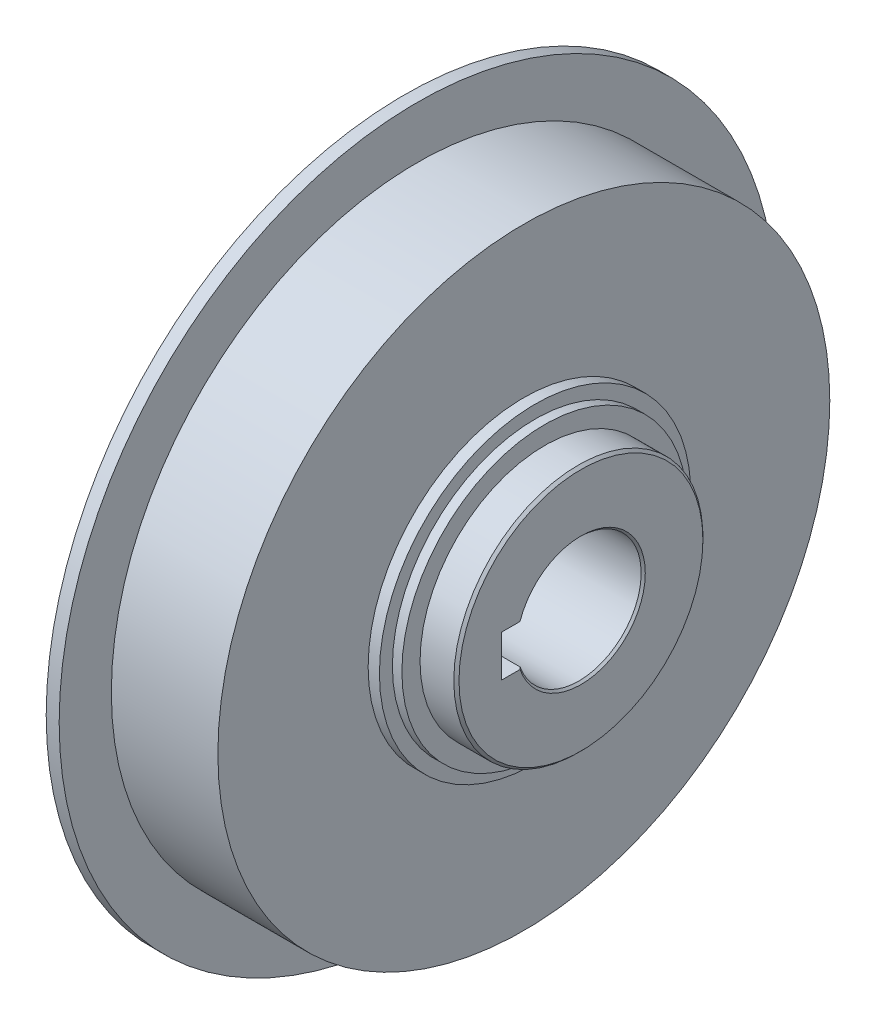
ISO-10303-21;
HEADER;
FILE_DESCRIPTION(('STEP AP214'),'2;1');
FILE_NAME('part.step','',(''),(''),'','','');
FILE_SCHEMA(('AUTOMOTIVE_DESIGN { 1 0 10303 214 1 1 1 1 }'));
ENDSEC;
DATA;
#1=APPLICATION_CONTEXT('core data for automotive mechanical design processes');
#2=APPLICATION_PROTOCOL_DEFINITION('international standard','automotive_design',2000,#1);
#3=PRODUCT_CONTEXT('',#1,'mechanical');
#4=PRODUCT('Part','Part','',(#3));
#5=PRODUCT_RELATED_PRODUCT_CATEGORY('part','',(#4));
#6=PRODUCT_DEFINITION_FORMATION('','',#4);
#7=PRODUCT_DEFINITION_CONTEXT('part definition',#1,'design');
#8=PRODUCT_DEFINITION('design','',#6,#7);
#9=PRODUCT_DEFINITION_SHAPE('','',#8);
#10=(LENGTH_UNIT() NAMED_UNIT(*) SI_UNIT(.MILLI.,.METRE.));
#11=(NAMED_UNIT(*) PLANE_ANGLE_UNIT() SI_UNIT($,.RADIAN.));
#12=(NAMED_UNIT(*) SI_UNIT($,.STERADIAN.) SOLID_ANGLE_UNIT());
#13=UNCERTAINTY_MEASURE_WITH_UNIT(LENGTH_MEASURE(1.E-05),#10,'distance_accuracy_value','');
#14=(GEOMETRIC_REPRESENTATION_CONTEXT(3) GLOBAL_UNCERTAINTY_ASSIGNED_CONTEXT((#13)) GLOBAL_UNIT_ASSIGNED_CONTEXT((#10,
#11,#12)) REPRESENTATION_CONTEXT('',''));
#15=CARTESIAN_POINT('',(0.,0.,0.));
#16=DIRECTION('',(0.,0.,1.));
#17=DIRECTION('',(1.,0.,0.));
#18=AXIS2_PLACEMENT_3D('',#15,#16,#17);
#19=CARTESIAN_POINT('',(83.1,0.,0.));
#20=DIRECTION('',(1.,0.,0.));
#21=DIRECTION('',(0.,0.,-1.));
#22=AXIS2_PLACEMENT_3D('',#19,#20,#21);
#23=CONICAL_SURFACE('',#22,12.4,0.78539816339744);
#24=CARTESIAN_POINT('',(82.7,0.,0.));
#25=DIRECTION('',(-1.,0.,0.));
#26=DIRECTION('',(0.,0.,1.));
#27=AXIS2_PLACEMENT_3D('',#24,#25,#26);
#28=CIRCLE('',#27,12.);
#29=CARTESIAN_POINT('',(82.7,4.,11.3137084989848));
#30=VERTEX_POINT('',#29);
#31=CARTESIAN_POINT('',(82.7,-4.,11.3137084989848));
#32=VERTEX_POINT('',#31);
#33=EDGE_CURVE('E80',#30,#32,#28,.T.);
#34=ORIENTED_EDGE('',*,*,#33,.T.);
#35=CARTESIAN_POINT('',(83.1,-4.,11.737120600897));
#36=CARTESIAN_POINT('',(83.0332637530497,-4.,11.6666176506962));
#37=CARTESIAN_POINT('',(82.9665622963739,-4.,11.5960818339105));
#38=CARTESIAN_POINT('',(82.83322896304,-4.,11.454944466607));
#39=CARTESIAN_POINT('',(82.7665970863825,-4.,11.3843429160886));
#40=CARTESIAN_POINT('',(82.7,-4.,11.3137084989848));
#41=B_SPLINE_CURVE_WITH_KNOTS('',3,(#35,#36,#37,#38,#39,#40),.UNSPECIFIED.,.F.,.F.,(4,2,4),(0.,
0.291237827128769,0.582475656578388),.UNSPECIFIED.);
#42=CARTESIAN_POINT('',(83.1,-4.,11.737120600897));
#43=VERTEX_POINT('',#42);
#44=EDGE_CURVE('E75',#43,#32,#41,.T.);
#45=ORIENTED_EDGE('',*,*,#44,.F.);
#46=CARTESIAN_POINT('',(83.1,0.,0.));
#47=DIRECTION('',(1.,0.,0.));
#48=DIRECTION('',(0.,0.,-1.));
#49=AXIS2_PLACEMENT_3D('',#46,#47,#48);
#50=CIRCLE('',#49,12.4);
#51=CARTESIAN_POINT('',(83.1,4.,11.737120600897));
#52=VERTEX_POINT('',#51);
#53=EDGE_CURVE('E73',#52,#43,#50,.F.);
#54=ORIENTED_EDGE('',*,*,#53,.F.);
#55=CARTESIAN_POINT('',(82.7,4.,11.3137084989848));
#56=CARTESIAN_POINT('',(82.7665970863825,4.,11.3843429160886));
#57=CARTESIAN_POINT('',(82.83322896304,4.,11.454944466607));
#58=CARTESIAN_POINT('',(82.9665622963739,4.,11.5960818339105));
#59=CARTESIAN_POINT('',(83.0332637530497,4.,11.6666176506962));
#60=CARTESIAN_POINT('',(83.1,4.,11.737120600897));
#61=B_SPLINE_CURVE_WITH_KNOTS('',3,(#55,#56,#57,#58,#59,#60),.UNSPECIFIED.,.F.,.F.,(4,2,4),(0.,
0.291237829449622,0.582475656578395),.UNSPECIFIED.);
#62=EDGE_CURVE('E21',#30,#52,#61,.T.);
#63=ORIENTED_EDGE('',*,*,#62,.F.);
#64=EDGE_LOOP('',(#34,#45,#54,#63));
#65=FACE_BOUND('',#64,.T.);
#66=ADVANCED_FACE('F17',(#65),#23,.F.);
#67=CARTESIAN_POINT('',(60.8,0.,0.));
#68=DIRECTION('',(-1.,0.,0.));
#69=DIRECTION('',(0.,0.,1.));
#70=AXIS2_PLACEMENT_3D('',#67,#68,#69);
#71=CYLINDRICAL_SURFACE('',#70,12.);
#72=ORIENTED_EDGE('',*,*,#33,.F.);
#73=DIRECTION('',(1.,0.,0.));
#74=VECTOR('',#73,1.);
#75=CARTESIAN_POINT('',(60.8,4.,11.3137084989848));
#76=LINE('',#75,#74);
#77=CARTESIAN_POINT('',(38.9,4.,11.3137084989848));
#78=VERTEX_POINT('',#77);
#79=EDGE_CURVE('E88',#78,#30,#76,.T.);
#80=ORIENTED_EDGE('',*,*,#79,.F.);
#81=CARTESIAN_POINT('',(38.9,0.,0.));
#82=DIRECTION('',(-1.,0.,0.));
#83=DIRECTION('',(0.,0.,1.));
#84=AXIS2_PLACEMENT_3D('',#81,#82,#83);
#85=CIRCLE('',#84,12.);
#86=CARTESIAN_POINT('',(38.9,-4.,11.3137084989848));
#87=VERTEX_POINT('',#86);
#88=EDGE_CURVE('E94',#78,#87,#85,.T.);
#89=ORIENTED_EDGE('',*,*,#88,.T.);
#90=DIRECTION('',(1.,0.,0.));
#91=VECTOR('',#90,1.);
#92=CARTESIAN_POINT('',(60.8,-4.,11.3137084989848));
#93=LINE('',#92,#91);
#94=EDGE_CURVE('E79',#32,#87,#93,.F.);
#95=ORIENTED_EDGE('',*,*,#94,.F.);
#96=EDGE_LOOP('',(#72,#80,#89,#95));
#97=FACE_BOUND('',#96,.T.);
#98=ADVANCED_FACE('F308',(#97),#71,.F.);
#99=CARTESIAN_POINT('',(83.1,0.,17.95));
#100=DIRECTION('',(1.,0.,0.));
#101=DIRECTION('',(0.,0.,-1.));
#102=AXIS2_PLACEMENT_3D('',#99,#100,#101);
#103=PLANE('',#102);
#104=DIRECTION('',(0.,0.,-1.));
#105=VECTOR('',#104,1.);
#106=CARTESIAN_POINT('',(83.1,4.,7.65));
#107=LINE('',#106,#105);
#108=CARTESIAN_POINT('',(83.1,4.,15.3));
#109=VERTEX_POINT('',#108);
#110=EDGE_CURVE('E85',#52,#109,#107,.F.);
#111=ORIENTED_EDGE('',*,*,#110,.F.);
#112=ORIENTED_EDGE('',*,*,#53,.T.);
#113=DIRECTION('',(0.,0.,1.));
#114=VECTOR('',#113,1.);
#115=CARTESIAN_POINT('',(83.1,-4.,7.65));
#116=LINE('',#115,#114);
#117=CARTESIAN_POINT('',(83.1,-4.,15.3));
#118=VERTEX_POINT('',#117);
#119=EDGE_CURVE('E110',#118,#43,#116,.F.);
#120=ORIENTED_EDGE('',*,*,#119,.F.);
#121=DIRECTION('',(0.,1.,0.));
#122=VECTOR('',#121,1.);
#123=CARTESIAN_POINT('',(83.1,0.,15.3));
#124=LINE('',#123,#122);
#125=EDGE_CURVE('E92',#118,#109,#124,.T.);
#126=ORIENTED_EDGE('',*,*,#125,.T.);
#127=EDGE_LOOP('',(#111,#112,#120,#126));
#128=FACE_BOUND('',#127,.T.);
#129=CARTESIAN_POINT('',(83.1,0.,0.));
#130=DIRECTION('',(-1.,0.,0.));
#131=DIRECTION('',(0.,0.,1.));
#132=AXIS2_PLACEMENT_3D('',#129,#130,#131);
#133=CIRCLE('',#132,23.5);
#134=CARTESIAN_POINT('',(83.1,0.,23.5));
#135=VERTEX_POINT('',#134);
#136=EDGE_CURVE('E149',#135,#135,#133,.T.);
#137=ORIENTED_EDGE('',*,*,#136,.F.);
#138=EDGE_LOOP('',(#137));
#139=FACE_BOUND('',#138,.T.);
#140=ADVANCED_FACE('F89',(#128,#139),#103,.T.);
#141=CARTESIAN_POINT('',(60.8,-4.,7.65));
#142=DIRECTION('',(0.,1.,0.));
#143=DIRECTION('',(0.,0.,1.));
#144=AXIS2_PLACEMENT_3D('',#141,#142,#143);
#145=PLANE('',#144);
#146=DIRECTION('',(1.,0.,0.));
#147=VECTOR('',#146,1.);
#148=CARTESIAN_POINT('',(60.8,-4.,15.3));
#149=LINE('',#148,#147);
#150=CARTESIAN_POINT('',(38.5,-4.,15.3));
#151=VERTEX_POINT('',#150);
#152=EDGE_CURVE('E384',#151,#118,#149,.T.);
#153=ORIENTED_EDGE('',*,*,#152,.T.);
#154=ORIENTED_EDGE('',*,*,#119,.T.);
#155=ORIENTED_EDGE('',*,*,#44,.T.);
#156=ORIENTED_EDGE('',*,*,#94,.T.);
#157=CARTESIAN_POINT('',(38.9,-4.,11.3137084989848));
#158=CARTESIAN_POINT('',(38.8334029136175,-4.,11.3843429160886));
#159=CARTESIAN_POINT('',(38.76677103696,-4.,11.454944466607));
#160=CARTESIAN_POINT('',(38.6334377036261,-4.,11.5960818339105));
#161=CARTESIAN_POINT('',(38.5667362469503,-4.,11.6666176506962));
#162=CARTESIAN_POINT('',(38.5,-4.,11.737120600897));
#163=B_SPLINE_CURVE_WITH_KNOTS('',3,(#157,#158,#159,#160,#161,#162),.UNSPECIFIED.,.F.,.F.,(4,2,
4),(0.,0.291237829449626,0.582475656578401),.UNSPECIFIED.);
#164=CARTESIAN_POINT('',(38.5,-4.,11.737120600897));
#165=VERTEX_POINT('',#164);
#166=EDGE_CURVE('E97',#87,#165,#163,.T.);
#167=ORIENTED_EDGE('',*,*,#166,.T.);
#168=DIRECTION('',(0.,0.,1.));
#169=VECTOR('',#168,1.);
#170=CARTESIAN_POINT('',(38.5,-4.,32.2625));
#171=LINE('',#170,#169);
#172=EDGE_CURVE('E148',#151,#165,#171,.F.);
#173=ORIENTED_EDGE('',*,*,#172,.F.);
#174=EDGE_LOOP('',(#153,#154,#155,#156,#167,#173));
#175=FACE_BOUND('',#174,.T.);
#176=ADVANCED_FACE('F295',(#175),#145,.T.);
#177=CARTESIAN_POINT('',(38.5,0.,0.));
#178=DIRECTION('',(-1.,0.,0.));
#179=DIRECTION('',(0.,0.,1.));
#180=AXIS2_PLACEMENT_3D('',#177,#178,#179);
#181=CONICAL_SURFACE('',#180,12.4,0.78539816339745);
#182=ORIENTED_EDGE('',*,*,#88,.F.);
#183=CARTESIAN_POINT('',(38.5,4.,11.737120600897));
#184=CARTESIAN_POINT('',(38.5667362469503,4.,11.6666176506962));
#185=CARTESIAN_POINT('',(38.6334377036261,4.,11.5960818339105));
#186=CARTESIAN_POINT('',(38.76677103696,4.,11.454944466607));
#187=CARTESIAN_POINT('',(38.8334029136175,4.,11.3843429160886));
#188=CARTESIAN_POINT('',(38.9,4.,11.3137084989848));
#189=B_SPLINE_CURVE_WITH_KNOTS('',3,(#183,#184,#185,#186,#187,#188),.UNSPECIFIED.,.F.,.F.,(4,2,
4),(0.,0.291237827128765,0.582475656578379),.UNSPECIFIED.);
#190=CARTESIAN_POINT('',(38.5,4.,11.737120600897));
#191=VERTEX_POINT('',#190);
#192=EDGE_CURVE('E93',#191,#78,#189,.T.);
#193=ORIENTED_EDGE('',*,*,#192,.F.);
#194=CARTESIAN_POINT('',(38.5,0.,0.));
#195=DIRECTION('',(-1.,0.,0.));
#196=DIRECTION('',(0.,0.,1.));
#197=AXIS2_PLACEMENT_3D('',#194,#195,#196);
#198=CIRCLE('',#197,12.4);
#199=EDGE_CURVE('E144',#165,#191,#198,.F.);
#200=ORIENTED_EDGE('',*,*,#199,.F.);
#201=ORIENTED_EDGE('',*,*,#166,.F.);
#202=EDGE_LOOP('',(#182,#193,#200,#201));
#203=FACE_BOUND('',#202,.T.);
#204=ADVANCED_FACE('F160',(#203),#181,.F.);
#205=CARTESIAN_POINT('',(60.8,4.,7.65));
#206=DIRECTION('',(0.,-1.,0.));
#207=DIRECTION('',(0.,0.,-1.));
#208=AXIS2_PLACEMENT_3D('',#205,#206,#207);
#209=PLANE('',#208);
#210=ORIENTED_EDGE('',*,*,#192,.T.);
#211=ORIENTED_EDGE('',*,*,#79,.T.);
#212=ORIENTED_EDGE('',*,*,#62,.T.);
#213=ORIENTED_EDGE('',*,*,#110,.T.);
#214=DIRECTION('',(1.,0.,0.));
#215=VECTOR('',#214,1.);
#216=CARTESIAN_POINT('',(60.8,4.,15.3));
#217=LINE('',#216,#215);
#218=CARTESIAN_POINT('',(38.5,4.,15.3));
#219=VERTEX_POINT('',#218);
#220=EDGE_CURVE('E40',#109,#219,#217,.F.);
#221=ORIENTED_EDGE('',*,*,#220,.T.);
#222=DIRECTION('',(0.,0.,1.));
#223=VECTOR('',#222,1.);
#224=CARTESIAN_POINT('',(38.5,4.,32.2625));
#225=LINE('',#224,#223);
#226=EDGE_CURVE('E147',#191,#219,#225,.T.);
#227=ORIENTED_EDGE('',*,*,#226,.F.);
#228=EDGE_LOOP('',(#210,#211,#212,#213,#221,#227));
#229=FACE_BOUND('',#228,.T.);
#230=ADVANCED_FACE('F84',(#229),#209,.T.);
#231=CARTESIAN_POINT('',(60.8,0.,15.3));
#232=DIRECTION('',(0.,0.,1.));
#233=DIRECTION('',(1.,0.,0.));
#234=AXIS2_PLACEMENT_3D('',#231,#232,#233);
#235=PLANE('',#234);
#236=ORIENTED_EDGE('',*,*,#152,.F.);
#237=DIRECTION('',(0.,1.,0.));
#238=VECTOR('',#237,1.);
#239=CARTESIAN_POINT('',(38.5,0.,15.3));
#240=LINE('',#239,#238);
#241=EDGE_CURVE('E392',#219,#151,#240,.F.);
#242=ORIENTED_EDGE('',*,*,#241,.F.);
#243=ORIENTED_EDGE('',*,*,#220,.F.);
#244=ORIENTED_EDGE('',*,*,#125,.F.);
#245=EDGE_LOOP('',(#236,#242,#243,#244));
#246=FACE_BOUND('',#245,.T.);
#247=ADVANCED_FACE('F165',(#246),#235,.F.);
#248=CARTESIAN_POINT('',(82.6,0.,0.));
#249=DIRECTION('',(-1.,0.,0.));
#250=DIRECTION('',(0.,0.,1.));
#251=AXIS2_PLACEMENT_3D('',#248,#249,#250);
#252=CONICAL_SURFACE('',#251,24.,0.785398163397448);
#253=ORIENTED_EDGE('',*,*,#136,.T.);
#254=EDGE_LOOP('',(#253));
#255=FACE_BOUND('',#254,.T.);
#256=CARTESIAN_POINT('',(82.6,0.,0.));
#257=DIRECTION('',(-1.,0.,0.));
#258=DIRECTION('',(0.,0.,1.));
#259=AXIS2_PLACEMENT_3D('',#256,#257,#258);
#260=CIRCLE('',#259,24.);
#261=CARTESIAN_POINT('',(82.6,0.,24.));
#262=VERTEX_POINT('',#261);
#263=EDGE_CURVE('E143',#262,#262,#260,.T.);
#264=ORIENTED_EDGE('',*,*,#263,.F.);
#265=EDGE_LOOP('',(#264));
#266=FACE_BOUND('',#265,.T.);
#267=ADVANCED_FACE('F169',(#255,#266),#252,.T.);
#268=CARTESIAN_POINT('',(38.5,0.,32.2625));
#269=DIRECTION('',(-1.,0.,0.));
#270=DIRECTION('',(0.,0.,1.));
#271=AXIS2_PLACEMENT_3D('',#268,#269,#270);
#272=PLANE('',#271);
#273=CARTESIAN_POINT('',(38.5,0.,0.));
#274=DIRECTION('',(-1.,0.,0.));
#275=DIRECTION('',(0.,0.,1.));
#276=AXIS2_PLACEMENT_3D('',#273,#274,#275);
#277=CIRCLE('',#276,52.125);
#278=CARTESIAN_POINT('',(38.5,0.,52.125));
#279=VERTEX_POINT('',#278);
#280=EDGE_CURVE('E140',#279,#279,#277,.F.);
#281=ORIENTED_EDGE('',*,*,#280,.F.);
#282=EDGE_LOOP('',(#281));
#283=FACE_BOUND('',#282,.T.);
#284=ORIENTED_EDGE('',*,*,#226,.T.);
#285=ORIENTED_EDGE('',*,*,#241,.T.);
#286=ORIENTED_EDGE('',*,*,#172,.T.);
#287=ORIENTED_EDGE('',*,*,#199,.T.);
#288=EDGE_LOOP('',(#284,#285,#286,#287));
#289=FACE_BOUND('',#288,.T.);
#290=ADVANCED_FACE('F173',(#283,#289),#272,.T.);
#291=CARTESIAN_POINT('',(79.35,0.,0.));
#292=DIRECTION('',(-1.,0.,0.));
#293=DIRECTION('',(0.,0.,1.));
#294=AXIS2_PLACEMENT_3D('',#291,#292,#293);
#295=CYLINDRICAL_SURFACE('',#294,24.);
#296=ORIENTED_EDGE('',*,*,#263,.T.);
#297=EDGE_LOOP('',(#296));
#298=FACE_BOUND('',#297,.T.);
#299=CARTESIAN_POINT('',(76.1,0.,0.));
#300=DIRECTION('',(-1.,0.,0.));
#301=DIRECTION('',(0.,0.,1.));
#302=AXIS2_PLACEMENT_3D('',#299,#300,#301);
#303=CIRCLE('',#302,24.);
#304=CARTESIAN_POINT('',(76.1,0.,24.));
#305=VERTEX_POINT('',#304);
#306=EDGE_CURVE('E137',#305,#305,#303,.T.);
#307=ORIENTED_EDGE('',*,*,#306,.F.);
#308=EDGE_LOOP('',(#307));
#309=FACE_BOUND('',#308,.T.);
#310=ADVANCED_FACE('F177',(#298,#309),#295,.T.);
#311=CARTESIAN_POINT('',(43.785,0.,0.));
#312=DIRECTION('',(-1.,0.,0.));
#313=DIRECTION('',(0.,0.,1.));
#314=AXIS2_PLACEMENT_3D('',#311,#312,#313);
#315=CYLINDRICAL_SURFACE('',#314,52.125);
#316=CARTESIAN_POINT('',(49.07,0.,0.));
#317=DIRECTION('',(-1.,0.,0.));
#318=DIRECTION('',(0.,0.,1.));
#319=AXIS2_PLACEMENT_3D('',#316,#317,#318);
#320=CIRCLE('',#319,52.125);
#321=CARTESIAN_POINT('',(49.07,0.,52.125));
#322=VERTEX_POINT('',#321);
#323=EDGE_CURVE('E134',#322,#322,#320,.F.);
#324=ORIENTED_EDGE('',*,*,#323,.F.);
#325=EDGE_LOOP('',(#324));
#326=FACE_BOUND('',#325,.T.);
#327=ORIENTED_EDGE('',*,*,#280,.T.);
#328=EDGE_LOOP('',(#327));
#329=FACE_BOUND('',#328,.T.);
#330=ADVANCED_FACE('F181',(#326,#329),#315,.T.);
#331=CARTESIAN_POINT('',(76.1,0.,25.75));
#332=DIRECTION('',(1.,0.,0.));
#333=DIRECTION('',(0.,0.,-1.));
#334=AXIS2_PLACEMENT_3D('',#331,#332,#333);
#335=PLANE('',#334);
#336=CARTESIAN_POINT('',(76.1,0.,0.));
#337=DIRECTION('',(-1.,0.,0.));
#338=DIRECTION('',(0.,0.,1.));
#339=AXIS2_PLACEMENT_3D('',#336,#337,#338);
#340=CIRCLE('',#339,27.5);
#341=CARTESIAN_POINT('',(76.1,0.,27.5));
#342=VERTEX_POINT('',#341);
#343=EDGE_CURVE('E131',#342,#342,#340,.T.);
#344=ORIENTED_EDGE('',*,*,#343,.F.);
#345=EDGE_LOOP('',(#344));
#346=FACE_BOUND('',#345,.T.);
#347=ORIENTED_EDGE('',*,*,#306,.T.);
#348=EDGE_LOOP('',(#347));
#349=FACE_BOUND('',#348,.T.);
#350=ADVANCED_FACE('F185',(#346,#349),#335,.T.);
#351=CARTESIAN_POINT('',(49.07,0.,60.5625));
#352=DIRECTION('',(-1.,0.,0.));
#353=DIRECTION('',(0.,0.,1.));
#354=AXIS2_PLACEMENT_3D('',#351,#352,#353);
#355=PLANE('',#354);
#356=ORIENTED_EDGE('',*,*,#323,.T.);
#357=EDGE_LOOP('',(#356));
#358=FACE_BOUND('',#357,.T.);
#359=CARTESIAN_POINT('',(49.07,0.,0.));
#360=DIRECTION('',(-1.,0.,0.));
#361=DIRECTION('',(0.,0.,1.));
#362=AXIS2_PLACEMENT_3D('',#359,#360,#361);
#363=CIRCLE('',#362,69.);
#364=CARTESIAN_POINT('',(49.07,0.,69.));
#365=VERTEX_POINT('',#364);
#366=EDGE_CURVE('E128',#365,#365,#363,.F.);
#367=ORIENTED_EDGE('',*,*,#366,.F.);
#368=EDGE_LOOP('',(#367));
#369=FACE_BOUND('',#368,.T.);
#370=ADVANCED_FACE('F189',(#358,#369),#355,.T.);
#371=CARTESIAN_POINT('',(75.185,0.,0.));
#372=DIRECTION('',(-1.,0.,0.));
#373=DIRECTION('',(0.,0.,1.));
#374=AXIS2_PLACEMENT_3D('',#371,#372,#373);
#375=CYLINDRICAL_SURFACE('',#374,27.5);
#376=ORIENTED_EDGE('',*,*,#343,.T.);
#377=EDGE_LOOP('',(#376));
#378=FACE_BOUND('',#377,.T.);
#379=CARTESIAN_POINT('',(74.27,0.,0.));
#380=DIRECTION('',(-1.,0.,0.));
#381=DIRECTION('',(0.,0.,1.));
#382=AXIS2_PLACEMENT_3D('',#379,#380,#381);
#383=CIRCLE('',#382,27.5);
#384=CARTESIAN_POINT('',(74.27,0.,27.5));
#385=VERTEX_POINT('',#384);
#386=EDGE_CURVE('E125',#385,#385,#383,.T.);
#387=ORIENTED_EDGE('',*,*,#386,.F.);
#388=EDGE_LOOP('',(#387));
#389=FACE_BOUND('',#388,.T.);
#390=ADVANCED_FACE('F193',(#378,#389),#375,.T.);
#391=CARTESIAN_POINT('',(50.32,0.,0.));
#392=DIRECTION('',(-1.,0.,0.));
#393=DIRECTION('',(0.,0.,1.));
#394=AXIS2_PLACEMENT_3D('',#391,#392,#393);
#395=CYLINDRICAL_SURFACE('',#394,69.);
#396=CARTESIAN_POINT('',(51.57,0.,0.));
#397=DIRECTION('',(-1.,0.,0.));
#398=DIRECTION('',(0.,0.,1.));
#399=AXIS2_PLACEMENT_3D('',#396,#397,#398);
#400=CIRCLE('',#399,69.);
#401=CARTESIAN_POINT('',(51.57,0.,69.));
#402=VERTEX_POINT('',#401);
#403=EDGE_CURVE('E122',#402,#402,#400,.F.);
#404=ORIENTED_EDGE('',*,*,#403,.F.);
#405=EDGE_LOOP('',(#404));
#406=FACE_BOUND('',#405,.T.);
#407=ORIENTED_EDGE('',*,*,#366,.T.);
#408=EDGE_LOOP('',(#407));
#409=FACE_BOUND('',#408,.T.);
#410=ADVANCED_FACE('F197',(#406,#409),#395,.T.);
#411=CARTESIAN_POINT('',(74.27,0.,28.75));
#412=DIRECTION('',(1.,0.,0.));
#413=DIRECTION('',(0.,0.,-1.));
#414=AXIS2_PLACEMENT_3D('',#411,#412,#413);
#415=PLANE('',#414);
#416=CARTESIAN_POINT('',(74.27,0.,0.));
#417=DIRECTION('',(-1.,0.,0.));
#418=DIRECTION('',(0.,0.,1.));
#419=AXIS2_PLACEMENT_3D('',#416,#417,#418);
#420=CIRCLE('',#419,30.);
#421=CARTESIAN_POINT('',(74.27,0.,30.));
#422=VERTEX_POINT('',#421);
#423=EDGE_CURVE('E119',#422,#422,#420,.T.);
#424=ORIENTED_EDGE('',*,*,#423,.F.);
#425=EDGE_LOOP('',(#424));
#426=FACE_BOUND('',#425,.T.);
#427=ORIENTED_EDGE('',*,*,#386,.T.);
#428=EDGE_LOOP('',(#427));
#429=FACE_BOUND('',#428,.T.);
#430=ADVANCED_FACE('F201',(#426,#429),#415,.T.);
#431=CARTESIAN_POINT('',(51.57,0.,63.975));
#432=DIRECTION('',(1.,0.,0.));
#433=DIRECTION('',(0.,0.,-1.));
#434=AXIS2_PLACEMENT_3D('',#431,#432,#433);
#435=PLANE('',#434);
#436=ORIENTED_EDGE('',*,*,#403,.T.);
#437=EDGE_LOOP('',(#436));
#438=FACE_BOUND('',#437,.T.);
#439=CARTESIAN_POINT('',(51.57,0.,0.));
#440=DIRECTION('',(-1.,0.,0.));
#441=DIRECTION('',(0.,0.,1.));
#442=AXIS2_PLACEMENT_3D('',#439,#440,#441);
#443=CIRCLE('',#442,58.95);
#444=CARTESIAN_POINT('',(51.57,0.,58.95));
#445=VERTEX_POINT('',#444);
#446=EDGE_CURVE('E116',#445,#445,#443,.F.);
#447=ORIENTED_EDGE('',*,*,#446,.F.);
#448=EDGE_LOOP('',(#447));
#449=FACE_BOUND('',#448,.T.);
#450=ADVANCED_FACE('F205',(#438,#449),#435,.T.);
#451=CARTESIAN_POINT('',(73.185,0.,0.));
#452=DIRECTION('',(-1.,0.,0.));
#453=DIRECTION('',(0.,0.,1.));
#454=AXIS2_PLACEMENT_3D('',#451,#452,#453);
#455=CYLINDRICAL_SURFACE('',#454,30.);
#456=ORIENTED_EDGE('',*,*,#423,.T.);
#457=EDGE_LOOP('',(#456));
#458=FACE_BOUND('',#457,.T.);
#459=CARTESIAN_POINT('',(72.1,0.,0.));
#460=DIRECTION('',(-1.,0.,0.));
#461=DIRECTION('',(0.,0.,1.));
#462=AXIS2_PLACEMENT_3D('',#459,#460,#461);
#463=CIRCLE('',#462,30.);
#464=CARTESIAN_POINT('',(72.1,0.,30.));
#465=VERTEX_POINT('',#464);
#466=EDGE_CURVE('E31',#465,#465,#463,.T.);
#467=ORIENTED_EDGE('',*,*,#466,.F.);
#468=EDGE_LOOP('',(#467));
#469=FACE_BOUND('',#468,.T.);
#470=ADVANCED_FACE('F209',(#458,#469),#455,.T.);
#471=CARTESIAN_POINT('',(61.835,0.,0.));
#472=DIRECTION('',(-1.,0.,0.));
#473=DIRECTION('',(0.,0.,1.));
#474=AXIS2_PLACEMENT_3D('',#471,#472,#473);
#475=CYLINDRICAL_SURFACE('',#474,58.95);
#476=CARTESIAN_POINT('',(72.1,0.,0.));
#477=DIRECTION('',(-1.,0.,0.));
#478=DIRECTION('',(0.,0.,1.));
#479=AXIS2_PLACEMENT_3D('',#476,#477,#478);
#480=CIRCLE('',#479,58.95);
#481=CARTESIAN_POINT('',(72.1,0.,58.95));
#482=VERTEX_POINT('',#481);
#483=EDGE_CURVE('E11',#482,#482,#480,.F.);
#484=ORIENTED_EDGE('',*,*,#483,.F.);
#485=EDGE_LOOP('',(#484));
#486=FACE_BOUND('',#485,.T.);
#487=ORIENTED_EDGE('',*,*,#446,.T.);
#488=EDGE_LOOP('',(#487));
#489=FACE_BOUND('',#488,.T.);
#490=ADVANCED_FACE('F213',(#486,#489),#475,.T.);
#491=CARTESIAN_POINT('',(72.1,0.,44.475));
#492=DIRECTION('',(1.,0.,0.));
#493=DIRECTION('',(0.,0.,-1.));
#494=AXIS2_PLACEMENT_3D('',#491,#492,#493);
#495=PLANE('',#494);
#496=ORIENTED_EDGE('',*,*,#483,.T.);
#497=EDGE_LOOP('',(#496));
#498=FACE_BOUND('',#497,.T.);
#499=ORIENTED_EDGE('',*,*,#466,.T.);
#500=EDGE_LOOP('',(#499));
#501=FACE_BOUND('',#500,.T.);
#502=ADVANCED_FACE('F217',(#498,#501),#495,.T.);
#503=CLOSED_SHELL('',(#66,#98,#140,#176,#204,#230,#247,#267,#290,#310,#330,#350,#370,#390,#410,
#430,#450,#470,#490,#502));
#504=MANIFOLD_SOLID_BREP('B1',#503);
#505=ADVANCED_BREP_SHAPE_REPRESENTATION('',(#18,#504),#14);
#506=SHAPE_DEFINITION_REPRESENTATION(#9,#505);
ENDSEC;
END-ISO-10303-21;
